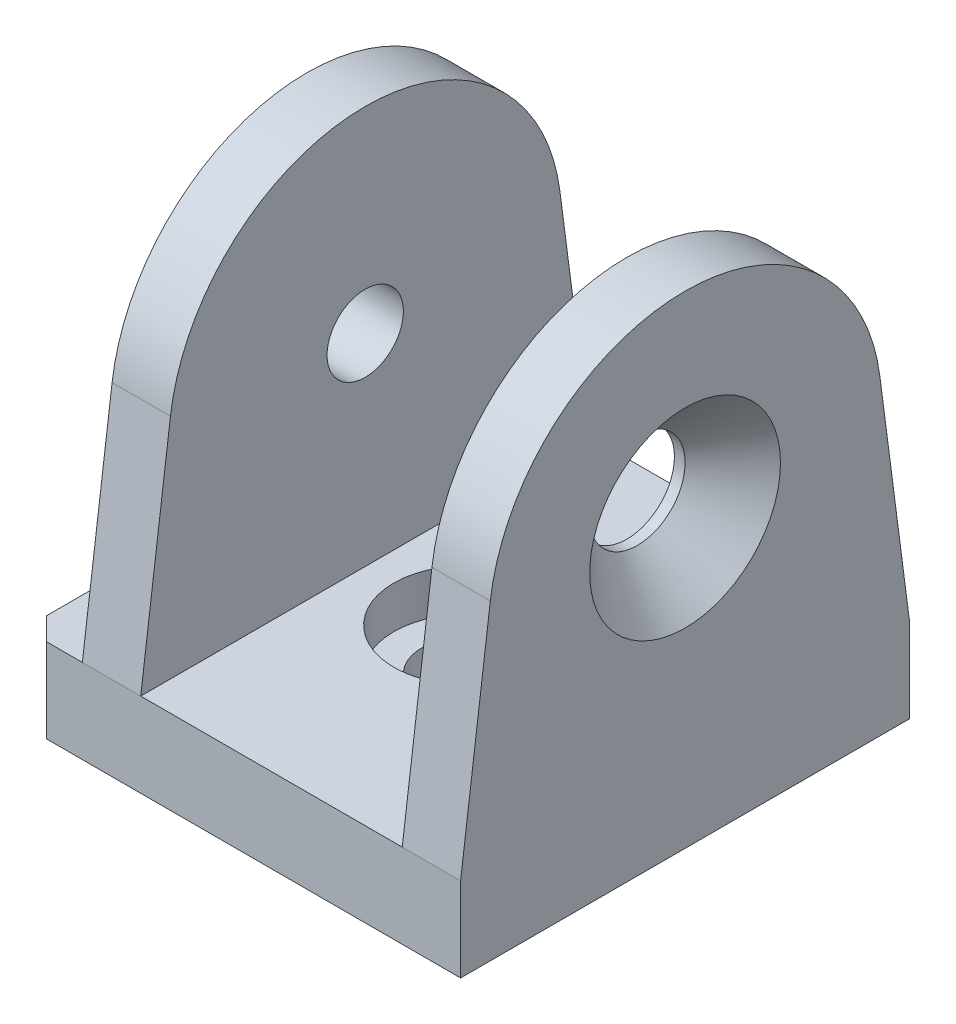
ISO-10303-21;
HEADER;
FILE_DESCRIPTION(('STEP AP214'),'2;1');
FILE_NAME('part.step','',(''),(''),'','','');
FILE_SCHEMA(('AUTOMOTIVE_DESIGN { 1 0 10303 214 1 1 1 1 }'));
ENDSEC;
DATA;
#1=APPLICATION_CONTEXT('core data for automotive mechanical design processes');
#2=APPLICATION_PROTOCOL_DEFINITION('international standard','automotive_design',2000,#1);
#3=PRODUCT_CONTEXT('',#1,'mechanical');
#4=PRODUCT('Part','Part','',(#3));
#5=PRODUCT_RELATED_PRODUCT_CATEGORY('part','',(#4));
#6=PRODUCT_DEFINITION_FORMATION('','',#4);
#7=PRODUCT_DEFINITION_CONTEXT('part definition',#1,'design');
#8=PRODUCT_DEFINITION('design','',#6,#7);
#9=PRODUCT_DEFINITION_SHAPE('','',#8);
#10=(LENGTH_UNIT() NAMED_UNIT(*) SI_UNIT(.MILLI.,.METRE.));
#11=(NAMED_UNIT(*) PLANE_ANGLE_UNIT() SI_UNIT($,.RADIAN.));
#12=(NAMED_UNIT(*) SI_UNIT($,.STERADIAN.) SOLID_ANGLE_UNIT());
#13=UNCERTAINTY_MEASURE_WITH_UNIT(LENGTH_MEASURE(1.E-05),#10,'distance_accuracy_value','');
#14=(GEOMETRIC_REPRESENTATION_CONTEXT(3) GLOBAL_UNCERTAINTY_ASSIGNED_CONTEXT((#13)) GLOBAL_UNIT_ASSIGNED_CONTEXT((#10,
#11,#12)) REPRESENTATION_CONTEXT('',''));
#15=CARTESIAN_POINT('',(0.,0.,0.));
#16=DIRECTION('',(0.,0.,1.));
#17=DIRECTION('',(1.,0.,0.));
#18=AXIS2_PLACEMENT_3D('',#15,#16,#17);
#19=CARTESIAN_POINT('',(-14.25,27.7667495892119,-17.3525746302907));
#20=DIRECTION('',(0.,0.129528547954964,-0.991575693159468));
#21=DIRECTION('',(0.,0.991575693159468,0.129528547954964));
#22=AXIS2_PLACEMENT_3D('',#19,#20,#21);
#23=PLANE('',#22);
#24=DIRECTION('',(0.,-0.991575693159468,-0.129528547954964));
#25=VECTOR('',#24,1.);
#26=CARTESIAN_POINT('',(14.25,27.7667495892119,-17.3525746302907));
#27=LINE('',#26,#25);
#28=CARTESIAN_POINT('',(14.25,27.7667495892119,-17.3525746302907));
#29=VERTEX_POINT('',#28);
#30=CARTESIAN_POINT('',(14.25,7.5,-20.));
#31=VERTEX_POINT('',#30);
#32=EDGE_CURVE('E145',#29,#31,#27,.T.);
#33=ORIENTED_EDGE('',*,*,#32,.F.);
#34=DIRECTION('',(1.,0.,0.));
#35=VECTOR('',#34,1.);
#36=CARTESIAN_POINT('',(-14.25,27.7667495892119,-17.3525746302907));
#37=LINE('',#36,#35);
#38=CARTESIAN_POINT('',(19.45,27.7667495892119,-17.3525746302907));
#39=VERTEX_POINT('',#38);
#40=EDGE_CURVE('E190',#29,#39,#37,.T.);
#41=ORIENTED_EDGE('',*,*,#40,.T.);
#42=DIRECTION('',(0.,0.991575693159468,0.129528547954964));
#43=VECTOR('',#42,1.);
#44=CARTESIAN_POINT('',(19.45,27.7667495892119,-17.3525746302907));
#45=LINE('',#44,#43);
#46=CARTESIAN_POINT('',(19.45,7.5,-20.));
#47=VERTEX_POINT('',#46);
#48=EDGE_CURVE('E258',#47,#39,#45,.T.);
#49=ORIENTED_EDGE('',*,*,#48,.F.);
#50=DIRECTION('',(-1.,0.,0.));
#51=VECTOR('',#50,1.);
#52=CARTESIAN_POINT('',(19.45,7.5,-20.));
#53=LINE('',#52,#51);
#54=EDGE_CURVE('E211',#47,#31,#53,.T.);
#55=ORIENTED_EDGE('',*,*,#54,.T.);
#56=EDGE_LOOP('',(#33,#41,#49,#55));
#57=FACE_BOUND('',#56,.T.);
#58=ADVANCED_FACE('F39',(#57),#23,.T.);
#59=CARTESIAN_POINT('',(-14.25,25.5,0.));
#60=DIRECTION('',(1.,0.,0.));
#61=DIRECTION('',(0.,0.,-1.));
#62=AXIS2_PLACEMENT_3D('',#59,#60,#61);
#63=CYLINDRICAL_SURFACE('',#62,17.5);
#64=DIRECTION('',(1.,0.,0.));
#65=VECTOR('',#64,1.);
#66=CARTESIAN_POINT('',(-14.25,27.7667495892119,17.3525746302907));
#67=LINE('',#66,#65);
#68=CARTESIAN_POINT('',(-14.25,27.7667495892119,17.3525746302907));
#69=VERTEX_POINT('',#68);
#70=CARTESIAN_POINT('',(-9.05000000000001,27.7667495892119,17.3525746302907));
#71=VERTEX_POINT('',#70);
#72=EDGE_CURVE('E178',#69,#71,#67,.T.);
#73=ORIENTED_EDGE('',*,*,#72,.T.);
#74=CARTESIAN_POINT('',(-9.05000000000001,25.5,0.));
#75=DIRECTION('',(-1.,0.,0.));
#76=DIRECTION('',(0.,-1.,0.));
#77=AXIS2_PLACEMENT_3D('',#74,#75,#76);
#78=CIRCLE('',#77,17.5);
#79=CARTESIAN_POINT('',(-9.05000000000001,27.7667495892119,-17.3525746302907));
#80=VERTEX_POINT('',#79);
#81=EDGE_CURVE('E149',#80,#71,#78,.F.);
#82=ORIENTED_EDGE('',*,*,#81,.F.);
#83=CARTESIAN_POINT('',(-14.25,27.7667495892119,-17.3525746302907));
#84=VERTEX_POINT('',#83);
#85=EDGE_CURVE('E187',#84,#80,#37,.T.);
#86=ORIENTED_EDGE('',*,*,#85,.F.);
#87=CARTESIAN_POINT('',(-14.25,25.5,0.));
#88=DIRECTION('',(1.,0.,0.));
#89=DIRECTION('',(0.,0.,1.));
#90=AXIS2_PLACEMENT_3D('',#87,#88,#89);
#91=CIRCLE('',#90,17.5);
#92=EDGE_CURVE('E313',#84,#69,#91,.T.);
#93=ORIENTED_EDGE('',*,*,#92,.T.);
#94=EDGE_LOOP('',(#73,#82,#86,#93));
#95=FACE_BOUND('',#94,.T.);
#96=ADVANCED_FACE('F273',(#95),#63,.T.);
#97=CARTESIAN_POINT('',(-14.25,7.5,20.));
#98=DIRECTION('',(0.,0.129528547954964,0.991575693159468));
#99=DIRECTION('',(0.,-0.991575693159468,0.129528547954964));
#100=AXIS2_PLACEMENT_3D('',#97,#98,#99);
#101=PLANE('',#100);
#102=DIRECTION('',(0.,0.991575693159468,-0.129528547954964));
#103=VECTOR('',#102,1.);
#104=CARTESIAN_POINT('',(14.25,7.5,20.));
#105=LINE('',#104,#103);
#106=CARTESIAN_POINT('',(14.25,7.5,20.));
#107=VERTEX_POINT('',#106);
#108=CARTESIAN_POINT('',(14.25,27.7667495892119,17.3525746302907));
#109=VERTEX_POINT('',#108);
#110=EDGE_CURVE('E142',#107,#109,#105,.T.);
#111=ORIENTED_EDGE('',*,*,#110,.F.);
#112=DIRECTION('',(1.,0.,0.));
#113=VECTOR('',#112,1.);
#114=CARTESIAN_POINT('',(-14.25,7.5,20.));
#115=LINE('',#114,#113);
#116=CARTESIAN_POINT('',(19.45,7.5,20.));
#117=VERTEX_POINT('',#116);
#118=EDGE_CURVE('E167',#107,#117,#115,.T.);
#119=ORIENTED_EDGE('',*,*,#118,.T.);
#120=DIRECTION('',(0.,-0.991575693159468,0.129528547954964));
#121=VECTOR('',#120,1.);
#122=CARTESIAN_POINT('',(19.45,7.5,20.));
#123=LINE('',#122,#121);
#124=CARTESIAN_POINT('',(19.45,27.7667495892119,17.3525746302907));
#125=VERTEX_POINT('',#124);
#126=EDGE_CURVE('E184',#125,#117,#123,.T.);
#127=ORIENTED_EDGE('',*,*,#126,.F.);
#128=EDGE_CURVE('E169',#109,#125,#67,.T.);
#129=ORIENTED_EDGE('',*,*,#128,.F.);
#130=EDGE_LOOP('',(#111,#119,#127,#129));
#131=FACE_BOUND('',#130,.T.);
#132=ADVANCED_FACE('F165',(#131),#101,.T.);
#133=CARTESIAN_POINT('',(0.,7.5,0.));
#134=DIRECTION('',(0.,1.,0.));
#135=DIRECTION('',(0.,0.,1.));
#136=AXIS2_PLACEMENT_3D('',#133,#134,#135);
#137=PLANE('',#136);
#138=CARTESIAN_POINT('',(-14.25,7.5,-20.));
#139=VERTEX_POINT('',#138);
#140=CARTESIAN_POINT('',(-17.45,7.5,-20.));
#141=VERTEX_POINT('',#140);
#142=EDGE_CURVE('E210',#139,#141,#53,.T.);
#143=ORIENTED_EDGE('',*,*,#142,.T.);
#144=DIRECTION('',(0.707106781186549,0.,-0.707106781186546));
#145=VECTOR('',#144,1.);
#146=CARTESIAN_POINT('',(-18.725,7.5,-18.725));
#147=LINE('',#146,#145);
#148=CARTESIAN_POINT('',(-19.45,7.5,-18.));
#149=VERTEX_POINT('',#148);
#150=EDGE_CURVE('E48',#141,#149,#147,.F.);
#151=ORIENTED_EDGE('',*,*,#150,.T.);
#152=DIRECTION('',(0.,0.,1.));
#153=VECTOR('',#152,1.);
#154=CARTESIAN_POINT('',(-19.45,7.5,20.));
#155=LINE('',#154,#153);
#156=CARTESIAN_POINT('',(-19.45,7.5,18.));
#157=VERTEX_POINT('',#156);
#158=EDGE_CURVE('E205',#149,#157,#155,.T.);
#159=ORIENTED_EDGE('',*,*,#158,.T.);
#160=DIRECTION('',(-0.707106781186546,0.,-0.707106781186549));
#161=VECTOR('',#160,1.);
#162=CARTESIAN_POINT('',(-18.725,7.5,18.725));
#163=LINE('',#162,#161);
#164=CARTESIAN_POINT('',(-17.45,7.5,20.));
#165=VERTEX_POINT('',#164);
#166=EDGE_CURVE('E55',#157,#165,#163,.F.);
#167=ORIENTED_EDGE('',*,*,#166,.T.);
#168=DIRECTION('',(1.,0.,0.));
#169=VECTOR('',#168,1.);
#170=CARTESIAN_POINT('',(19.45,7.5,20.));
#171=LINE('',#170,#169);
#172=CARTESIAN_POINT('',(-14.25,7.5,20.));
#173=VERTEX_POINT('',#172);
#174=EDGE_CURVE('E207',#165,#173,#171,.T.);
#175=ORIENTED_EDGE('',*,*,#174,.T.);
#176=DIRECTION('',(0.,0.,-1.));
#177=VECTOR('',#176,1.);
#178=CARTESIAN_POINT('',(-14.25,7.5,-20.));
#179=LINE('',#178,#177);
#180=EDGE_CURVE('E318',#173,#139,#179,.T.);
#181=ORIENTED_EDGE('',*,*,#180,.T.);
#182=EDGE_LOOP('',(#143,#151,#159,#167,#175,#181));
#183=FACE_BOUND('',#182,.T.);
#184=ADVANCED_FACE('F238',(#183),#137,.T.);
#185=CARTESIAN_POINT('',(-19.45,7.5,20.));
#186=DIRECTION('',(1.,0.,0.));
#187=DIRECTION('',(0.,0.,-1.));
#188=AXIS2_PLACEMENT_3D('',#185,#186,#187);
#189=PLANE('',#188);
#190=ORIENTED_EDGE('',*,*,#158,.F.);
#191=DIRECTION('',(0.,-1.,0.));
#192=VECTOR('',#191,1.);
#193=CARTESIAN_POINT('',(-19.45,7.5,-18.));
#194=LINE('',#193,#192);
#195=CARTESIAN_POINT('',(-19.45,0.,-18.));
#196=VERTEX_POINT('',#195);
#197=EDGE_CURVE('E228',#149,#196,#194,.T.);
#198=ORIENTED_EDGE('',*,*,#197,.T.);
#199=DIRECTION('',(0.,0.,1.));
#200=VECTOR('',#199,1.);
#201=CARTESIAN_POINT('',(-19.45,0.,20.));
#202=LINE('',#201,#200);
#203=CARTESIAN_POINT('',(-19.45,0.,18.));
#204=VERTEX_POINT('',#203);
#205=EDGE_CURVE('E204',#196,#204,#202,.T.);
#206=ORIENTED_EDGE('',*,*,#205,.T.);
#207=DIRECTION('',(0.,1.,0.));
#208=VECTOR('',#207,1.);
#209=CARTESIAN_POINT('',(-19.45,7.5,18.));
#210=LINE('',#209,#208);
#211=EDGE_CURVE('E170',#204,#157,#210,.T.);
#212=ORIENTED_EDGE('',*,*,#211,.T.);
#213=EDGE_LOOP('',(#190,#198,#206,#212));
#214=FACE_BOUND('',#213,.T.);
#215=ADVANCED_FACE('F243',(#214),#189,.F.);
#216=CARTESIAN_POINT('',(19.45,7.5,20.));
#217=DIRECTION('',(0.,0.,-1.));
#218=DIRECTION('',(-1.,0.,0.));
#219=AXIS2_PLACEMENT_3D('',#216,#217,#218);
#220=PLANE('',#219);
#221=ORIENTED_EDGE('',*,*,#174,.F.);
#222=DIRECTION('',(0.,-1.,0.));
#223=VECTOR('',#222,1.);
#224=CARTESIAN_POINT('',(-17.45,7.5,20.));
#225=LINE('',#224,#223);
#226=CARTESIAN_POINT('',(-17.45,0.,20.));
#227=VERTEX_POINT('',#226);
#228=EDGE_CURVE('E11',#165,#227,#225,.T.);
#229=ORIENTED_EDGE('',*,*,#228,.T.);
#230=DIRECTION('',(1.,0.,0.));
#231=VECTOR('',#230,1.);
#232=CARTESIAN_POINT('',(19.45,0.,20.));
#233=LINE('',#232,#231);
#234=CARTESIAN_POINT('',(19.45,0.,20.));
#235=VERTEX_POINT('',#234);
#236=EDGE_CURVE('E218',#227,#235,#233,.T.);
#237=ORIENTED_EDGE('',*,*,#236,.T.);
#238=DIRECTION('',(0.,-1.,0.));
#239=VECTOR('',#238,1.);
#240=CARTESIAN_POINT('',(19.45,7.5,20.));
#241=LINE('',#240,#239);
#242=EDGE_CURVE('E176',#117,#235,#241,.T.);
#243=ORIENTED_EDGE('',*,*,#242,.F.);
#244=ORIENTED_EDGE('',*,*,#118,.F.);
#245=DIRECTION('',(1.,0.,0.));
#246=VECTOR('',#245,1.);
#247=CARTESIAN_POINT('',(14.25,7.5,20.));
#248=LINE('',#247,#246);
#249=CARTESIAN_POINT('',(-9.05000000000001,7.5,20.));
#250=VERTEX_POINT('',#249);
#251=EDGE_CURVE('E153',#250,#107,#248,.T.);
#252=ORIENTED_EDGE('',*,*,#251,.F.);
#253=EDGE_CURVE('E177',#173,#250,#115,.T.);
#254=ORIENTED_EDGE('',*,*,#253,.F.);
#255=EDGE_LOOP('',(#221,#229,#237,#243,#244,#252,#254));
#256=FACE_BOUND('',#255,.T.);
#257=ADVANCED_FACE('F174',(#256),#220,.F.);
#258=CARTESIAN_POINT('',(19.45,7.5,20.));
#259=DIRECTION('',(-1.,0.,0.));
#260=DIRECTION('',(0.,0.,1.));
#261=AXIS2_PLACEMENT_3D('',#258,#259,#260);
#262=PLANE('',#261);
#263=CARTESIAN_POINT('',(19.45,25.5,0.));
#264=DIRECTION('',(1.,0.,0.));
#265=DIRECTION('',(0.,0.,-1.));
#266=AXIS2_PLACEMENT_3D('',#263,#264,#265);
#267=CIRCLE('',#266,8.5);
#268=CARTESIAN_POINT('',(19.45,25.5,-8.5));
#269=VERTEX_POINT('',#268);
#270=EDGE_CURVE('E328',#269,#269,#267,.T.);
#271=ORIENTED_EDGE('',*,*,#270,.F.);
#272=EDGE_LOOP('',(#271));
#273=FACE_BOUND('',#272,.T.);
#274=DIRECTION('',(0.,0.,-1.));
#275=VECTOR('',#274,1.);
#276=CARTESIAN_POINT('',(19.45,0.,20.));
#277=LINE('',#276,#275);
#278=CARTESIAN_POINT('',(19.45,0.,-20.));
#279=VERTEX_POINT('',#278);
#280=EDGE_CURVE('E220',#235,#279,#277,.T.);
#281=ORIENTED_EDGE('',*,*,#280,.T.);
#282=DIRECTION('',(0.,-1.,0.));
#283=VECTOR('',#282,1.);
#284=CARTESIAN_POINT('',(19.45,7.5,-20.));
#285=LINE('',#284,#283);
#286=EDGE_CURVE('E214',#47,#279,#285,.T.);
#287=ORIENTED_EDGE('',*,*,#286,.F.);
#288=ORIENTED_EDGE('',*,*,#48,.T.);
#289=CARTESIAN_POINT('',(19.45,25.5,0.));
#290=DIRECTION('',(1.,0.,0.));
#291=DIRECTION('',(0.,0.,1.));
#292=AXIS2_PLACEMENT_3D('',#289,#290,#291);
#293=CIRCLE('',#292,17.5);
#294=EDGE_CURVE('E306',#39,#125,#293,.T.);
#295=ORIENTED_EDGE('',*,*,#294,.T.);
#296=ORIENTED_EDGE('',*,*,#126,.T.);
#297=ORIENTED_EDGE('',*,*,#242,.T.);
#298=EDGE_LOOP('',(#281,#287,#288,#295,#296,#297));
#299=FACE_BOUND('',#298,.T.);
#300=ADVANCED_FACE('F256',(#273,#299),#262,.F.);
#301=CARTESIAN_POINT('',(19.45,7.5,-20.));
#302=DIRECTION('',(0.,0.,1.));
#303=DIRECTION('',(1.,0.,0.));
#304=AXIS2_PLACEMENT_3D('',#301,#302,#303);
#305=PLANE('',#304);
#306=DIRECTION('',(-1.,0.,0.));
#307=VECTOR('',#306,1.);
#308=CARTESIAN_POINT('',(19.45,0.,-20.));
#309=LINE('',#308,#307);
#310=CARTESIAN_POINT('',(-17.45,0.,-20.));
#311=VERTEX_POINT('',#310);
#312=EDGE_CURVE('E208',#279,#311,#309,.T.);
#313=ORIENTED_EDGE('',*,*,#312,.T.);
#314=DIRECTION('',(0.,1.,0.));
#315=VECTOR('',#314,1.);
#316=CARTESIAN_POINT('',(-17.45,7.5,-20.));
#317=LINE('',#316,#315);
#318=EDGE_CURVE('E63',#311,#141,#317,.T.);
#319=ORIENTED_EDGE('',*,*,#318,.T.);
#320=ORIENTED_EDGE('',*,*,#142,.F.);
#321=CARTESIAN_POINT('',(-9.05,7.5,-20.));
#322=VERTEX_POINT('',#321);
#323=EDGE_CURVE('E215',#322,#139,#53,.T.);
#324=ORIENTED_EDGE('',*,*,#323,.F.);
#325=DIRECTION('',(1.,0.,0.));
#326=VECTOR('',#325,1.);
#327=CARTESIAN_POINT('',(14.25,7.5,-20.));
#328=LINE('',#327,#326);
#329=EDGE_CURVE('E161',#322,#31,#328,.T.);
#330=ORIENTED_EDGE('',*,*,#329,.T.);
#331=ORIENTED_EDGE('',*,*,#54,.F.);
#332=ORIENTED_EDGE('',*,*,#286,.T.);
#333=EDGE_LOOP('',(#313,#319,#320,#324,#330,#331,#332));
#334=FACE_BOUND('',#333,.T.);
#335=ADVANCED_FACE('F251',(#334),#305,.F.);
#336=CARTESIAN_POINT('',(0.,0.,0.));
#337=DIRECTION('',(0.,1.,0.));
#338=DIRECTION('',(0.,0.,1.));
#339=AXIS2_PLACEMENT_3D('',#336,#337,#338);
#340=PLANE('',#339);
#341=CARTESIAN_POINT('',(0.,0.,0.));
#342=DIRECTION('',(0.,1.,0.));
#343=DIRECTION('',(-1.,0.,0.));
#344=AXIS2_PLACEMENT_3D('',#341,#342,#343);
#345=CIRCLE('',#344,4.);
#346=CARTESIAN_POINT('',(-4.,0.,0.));
#347=VERTEX_POINT('',#346);
#348=EDGE_CURVE('E201',#347,#347,#345,.T.);
#349=ORIENTED_EDGE('',*,*,#348,.T.);
#350=EDGE_LOOP('',(#349));
#351=FACE_BOUND('',#350,.T.);
#352=ORIENTED_EDGE('',*,*,#205,.F.);
#353=DIRECTION('',(-0.707106781186549,0.,0.707106781186546));
#354=VECTOR('',#353,1.);
#355=CARTESIAN_POINT('',(-19.45,0.,-18.));
#356=LINE('',#355,#354);
#357=EDGE_CURVE('E233',#196,#311,#356,.F.);
#358=ORIENTED_EDGE('',*,*,#357,.T.);
#359=ORIENTED_EDGE('',*,*,#312,.F.);
#360=ORIENTED_EDGE('',*,*,#280,.F.);
#361=ORIENTED_EDGE('',*,*,#236,.F.);
#362=DIRECTION('',(0.707106781186546,0.,0.707106781186549));
#363=VECTOR('',#362,1.);
#364=CARTESIAN_POINT('',(-17.45,0.,20.));
#365=LINE('',#364,#363);
#366=EDGE_CURVE('E231',#227,#204,#365,.F.);
#367=ORIENTED_EDGE('',*,*,#366,.T.);
#368=EDGE_LOOP('',(#352,#358,#359,#360,#361,#367));
#369=FACE_BOUND('',#368,.T.);
#370=ADVANCED_FACE('F249',(#351,#369),#340,.F.);
#371=CARTESIAN_POINT('',(0.,7.5,0.));
#372=DIRECTION('',(0.,1.,0.));
#373=DIRECTION('',(-1.,0.,0.));
#374=AXIS2_PLACEMENT_3D('',#371,#372,#373);
#375=CYLINDRICAL_SURFACE('',#374,4.);
#376=ORIENTED_EDGE('',*,*,#348,.F.);
#377=EDGE_LOOP('',(#376));
#378=FACE_BOUND('',#377,.T.);
#379=CARTESIAN_POINT('',(0.,3.75,0.));
#380=DIRECTION('',(0.,1.,0.));
#381=DIRECTION('',(-1.,0.,0.));
#382=AXIS2_PLACEMENT_3D('',#379,#380,#381);
#383=CIRCLE('',#382,4.);
#384=CARTESIAN_POINT('',(-4.,3.75,0.));
#385=VERTEX_POINT('',#384);
#386=EDGE_CURVE('E198',#385,#385,#383,.T.);
#387=ORIENTED_EDGE('',*,*,#386,.T.);
#388=EDGE_LOOP('',(#387));
#389=FACE_BOUND('',#388,.T.);
#390=ADVANCED_FACE('F370',(#378,#389),#375,.F.);
#391=CARTESIAN_POINT('',(-4.,3.75,0.));
#392=DIRECTION('',(0.,-1.,0.));
#393=DIRECTION('',(1.,0.,0.));
#394=AXIS2_PLACEMENT_3D('',#391,#392,#393);
#395=PLANE('',#394);
#396=ORIENTED_EDGE('',*,*,#386,.F.);
#397=EDGE_LOOP('',(#396));
#398=FACE_BOUND('',#397,.T.);
#399=CARTESIAN_POINT('',(0.,3.75000000000001,0.));
#400=DIRECTION('',(0.,1.,0.));
#401=DIRECTION('',(-1.,0.,0.));
#402=AXIS2_PLACEMENT_3D('',#399,#400,#401);
#403=CIRCLE('',#402,6.5);
#404=CARTESIAN_POINT('',(-6.5,3.75,0.));
#405=VERTEX_POINT('',#404);
#406=EDGE_CURVE('E180',#405,#405,#403,.T.);
#407=ORIENTED_EDGE('',*,*,#406,.T.);
#408=EDGE_LOOP('',(#407));
#409=FACE_BOUND('',#408,.T.);
#410=ADVANCED_FACE('F410',(#398,#409),#395,.F.);
#411=CARTESIAN_POINT('',(0.,7.5,0.));
#412=DIRECTION('',(0.,1.,0.));
#413=DIRECTION('',(-1.,0.,0.));
#414=AXIS2_PLACEMENT_3D('',#411,#412,#413);
#415=CYLINDRICAL_SURFACE('',#414,6.5);
#416=ORIENTED_EDGE('',*,*,#406,.F.);
#417=EDGE_LOOP('',(#416));
#418=FACE_BOUND('',#417,.T.);
#419=CARTESIAN_POINT('',(0.,7.50000000000001,0.));
#420=DIRECTION('',(0.,1.,0.));
#421=DIRECTION('',(-1.,0.,0.));
#422=AXIS2_PLACEMENT_3D('',#419,#420,#421);
#423=CIRCLE('',#422,6.5);
#424=CARTESIAN_POINT('',(-6.5,7.5,0.));
#425=VERTEX_POINT('',#424);
#426=EDGE_CURVE('E191',#425,#425,#423,.T.);
#427=ORIENTED_EDGE('',*,*,#426,.T.);
#428=EDGE_LOOP('',(#427));
#429=FACE_BOUND('',#428,.T.);
#430=ADVANCED_FACE('F293',(#418,#429),#415,.F.);
#431=CARTESIAN_POINT('',(-14.25,25.5,0.));
#432=DIRECTION('',(-1.,0.,0.));
#433=DIRECTION('',(0.,0.,1.));
#434=AXIS2_PLACEMENT_3D('',#431,#432,#433);
#435=PLANE('',#434);
#436=CARTESIAN_POINT('',(-14.25,25.5,0.));
#437=DIRECTION('',(-1.,0.,0.));
#438=DIRECTION('',(0.,0.,1.));
#439=AXIS2_PLACEMENT_3D('',#436,#437,#438);
#440=CIRCLE('',#439,3.4);
#441=CARTESIAN_POINT('',(-14.25,25.5,3.4));
#442=VERTEX_POINT('',#441);
#443=EDGE_CURVE('E334',#442,#442,#440,.T.);
#444=ORIENTED_EDGE('',*,*,#443,.F.);
#445=EDGE_LOOP('',(#444));
#446=FACE_BOUND('',#445,.T.);
#447=ORIENTED_EDGE('',*,*,#180,.F.);
#448=DIRECTION('',(0.,-0.991575693159468,0.129528547954964));
#449=VECTOR('',#448,1.);
#450=CARTESIAN_POINT('',(-14.25,7.5,20.));
#451=LINE('',#450,#449);
#452=EDGE_CURVE('E310',#69,#173,#451,.T.);
#453=ORIENTED_EDGE('',*,*,#452,.F.);
#454=ORIENTED_EDGE('',*,*,#92,.F.);
#455=DIRECTION('',(0.,0.991575693159468,0.129528547954964));
#456=VECTOR('',#455,1.);
#457=CARTESIAN_POINT('',(-14.25,27.7667495892119,-17.3525746302907));
#458=LINE('',#457,#456);
#459=EDGE_CURVE('E316',#139,#84,#458,.T.);
#460=ORIENTED_EDGE('',*,*,#459,.F.);
#461=EDGE_LOOP('',(#447,#453,#454,#460));
#462=FACE_BOUND('',#461,.T.);
#463=ADVANCED_FACE('F285',(#446,#462),#435,.T.);
#464=DIRECTION('',(0.,0.991575693159468,0.129528547954964));
#465=VECTOR('',#464,1.);
#466=CARTESIAN_POINT('',(-9.05000000000001,27.7667495892119,-17.3525746302907));
#467=LINE('',#466,#465);
#468=EDGE_CURVE('E195',#322,#80,#467,.T.);
#469=ORIENTED_EDGE('',*,*,#468,.F.);
#470=ORIENTED_EDGE('',*,*,#323,.T.);
#471=ORIENTED_EDGE('',*,*,#459,.T.);
#472=ORIENTED_EDGE('',*,*,#85,.T.);
#473=EDGE_LOOP('',(#469,#470,#471,#472));
#474=FACE_BOUND('',#473,.T.);
#475=ADVANCED_FACE('F276',(#474),#23,.T.);
#476=CARTESIAN_POINT('',(14.25,25.5,0.));
#477=DIRECTION('',(1.,0.,0.));
#478=DIRECTION('',(0.,0.,-1.));
#479=AXIS2_PLACEMENT_3D('',#476,#477,#478);
#480=CIRCLE('',#479,17.5);
#481=EDGE_CURVE('E194',#109,#29,#480,.F.);
#482=ORIENTED_EDGE('',*,*,#481,.F.);
#483=ORIENTED_EDGE('',*,*,#128,.T.);
#484=ORIENTED_EDGE('',*,*,#294,.F.);
#485=ORIENTED_EDGE('',*,*,#40,.F.);
#486=EDGE_LOOP('',(#482,#483,#484,#485));
#487=FACE_BOUND('',#486,.T.);
#488=ADVANCED_FACE('F282',(#487),#63,.T.);
#489=DIRECTION('',(0.,-0.991575693159468,0.129528547954964));
#490=VECTOR('',#489,1.);
#491=CARTESIAN_POINT('',(-9.05,7.5,20.));
#492=LINE('',#491,#490);
#493=EDGE_CURVE('E171',#71,#250,#492,.T.);
#494=ORIENTED_EDGE('',*,*,#493,.F.);
#495=ORIENTED_EDGE('',*,*,#72,.F.);
#496=ORIENTED_EDGE('',*,*,#452,.T.);
#497=ORIENTED_EDGE('',*,*,#253,.T.);
#498=EDGE_LOOP('',(#494,#495,#496,#497));
#499=FACE_BOUND('',#498,.T.);
#500=ADVANCED_FACE('F291',(#499),#101,.T.);
#501=CARTESIAN_POINT('',(14.25,7.5,-20.));
#502=DIRECTION('',(0.,-1.,0.));
#503=DIRECTION('',(1.,0.,0.));
#504=AXIS2_PLACEMENT_3D('',#501,#502,#503);
#505=PLANE('',#504);
#506=DIRECTION('',(0.,0.,1.));
#507=VECTOR('',#506,1.);
#508=CARTESIAN_POINT('',(14.25,7.5,-20.));
#509=LINE('',#508,#507);
#510=EDGE_CURVE('E138',#31,#107,#509,.T.);
#511=ORIENTED_EDGE('',*,*,#510,.F.);
#512=ORIENTED_EDGE('',*,*,#329,.F.);
#513=DIRECTION('',(0.,0.,1.));
#514=VECTOR('',#513,1.);
#515=CARTESIAN_POINT('',(-9.05,7.5,-20.));
#516=LINE('',#515,#514);
#517=EDGE_CURVE('E150',#322,#250,#516,.T.);
#518=ORIENTED_EDGE('',*,*,#517,.T.);
#519=ORIENTED_EDGE('',*,*,#251,.T.);
#520=EDGE_LOOP('',(#511,#512,#518,#519));
#521=FACE_BOUND('',#520,.T.);
#522=ORIENTED_EDGE('',*,*,#426,.F.);
#523=EDGE_LOOP('',(#522));
#524=FACE_BOUND('',#523,.T.);
#525=ADVANCED_FACE('F154',(#521,#524),#505,.F.);
#526=CARTESIAN_POINT('',(14.25,7.5,-20.));
#527=DIRECTION('',(1.,0.,0.));
#528=DIRECTION('',(0.,0.,-1.));
#529=AXIS2_PLACEMENT_3D('',#526,#527,#528);
#530=PLANE('',#529);
#531=CARTESIAN_POINT('',(14.25,25.5,0.));
#532=DIRECTION('',(1.,0.,0.));
#533=DIRECTION('',(0.,0.,-1.));
#534=AXIS2_PLACEMENT_3D('',#531,#532,#533);
#535=CIRCLE('',#534,4.25);
#536=CARTESIAN_POINT('',(14.25,25.5,-4.25));
#537=VERTEX_POINT('',#536);
#538=EDGE_CURVE('E162',#537,#537,#535,.T.);
#539=ORIENTED_EDGE('',*,*,#538,.T.);
#540=EDGE_LOOP('',(#539));
#541=FACE_BOUND('',#540,.T.);
#542=ORIENTED_EDGE('',*,*,#32,.T.);
#543=ORIENTED_EDGE('',*,*,#510,.T.);
#544=ORIENTED_EDGE('',*,*,#110,.T.);
#545=ORIENTED_EDGE('',*,*,#481,.T.);
#546=EDGE_LOOP('',(#542,#543,#544,#545));
#547=FACE_BOUND('',#546,.T.);
#548=ADVANCED_FACE('F140',(#541,#547),#530,.F.);
#549=CARTESIAN_POINT('',(-9.05,7.5,-20.));
#550=DIRECTION('',(-1.,0.,0.));
#551=DIRECTION('',(0.,-1.,0.));
#552=AXIS2_PLACEMENT_3D('',#549,#550,#551);
#553=PLANE('',#552);
#554=CARTESIAN_POINT('',(-9.05000000000001,25.5,0.));
#555=DIRECTION('',(-1.,0.,0.));
#556=DIRECTION('',(0.,-1.,0.));
#557=AXIS2_PLACEMENT_3D('',#554,#555,#556);
#558=CIRCLE('',#557,3.4);
#559=CARTESIAN_POINT('',(-9.05000000000001,22.1,0.));
#560=VERTEX_POINT('',#559);
#561=EDGE_CURVE('E331',#560,#560,#558,.T.);
#562=ORIENTED_EDGE('',*,*,#561,.T.);
#563=EDGE_LOOP('',(#562));
#564=FACE_BOUND('',#563,.T.);
#565=ORIENTED_EDGE('',*,*,#468,.T.);
#566=ORIENTED_EDGE('',*,*,#81,.T.);
#567=ORIENTED_EDGE('',*,*,#493,.T.);
#568=ORIENTED_EDGE('',*,*,#517,.F.);
#569=EDGE_LOOP('',(#565,#566,#567,#568));
#570=FACE_BOUND('',#569,.T.);
#571=ADVANCED_FACE('F271',(#564,#570),#553,.F.);
#572=CARTESIAN_POINT('',(-19.45,7.5,-18.));
#573=DIRECTION('',(0.707106781186546,0.,0.707106781186549));
#574=DIRECTION('',(0.,-1.,0.));
#575=AXIS2_PLACEMENT_3D('',#572,#573,#574);
#576=PLANE('',#575);
#577=ORIENTED_EDGE('',*,*,#150,.F.);
#578=ORIENTED_EDGE('',*,*,#318,.F.);
#579=ORIENTED_EDGE('',*,*,#357,.F.);
#580=ORIENTED_EDGE('',*,*,#197,.F.);
#581=EDGE_LOOP('',(#577,#578,#579,#580));
#582=FACE_BOUND('',#581,.T.);
#583=ADVANCED_FACE('F246',(#582),#576,.F.);
#584=CARTESIAN_POINT('',(-17.45,7.5,20.));
#585=DIRECTION('',(0.707106781186549,0.,-0.707106781186546));
#586=DIRECTION('',(0.,-1.,0.));
#587=AXIS2_PLACEMENT_3D('',#584,#585,#586);
#588=PLANE('',#587);
#589=ORIENTED_EDGE('',*,*,#166,.F.);
#590=ORIENTED_EDGE('',*,*,#211,.F.);
#591=ORIENTED_EDGE('',*,*,#366,.F.);
#592=ORIENTED_EDGE('',*,*,#228,.F.);
#593=EDGE_LOOP('',(#589,#590,#591,#592));
#594=FACE_BOUND('',#593,.T.);
#595=ADVANCED_FACE('F42',(#594),#588,.F.);
#596=CARTESIAN_POINT('',(19.45,25.5,0.));
#597=DIRECTION('',(1.,0.,0.));
#598=DIRECTION('',(0.,0.,-1.));
#599=AXIS2_PLACEMENT_3D('',#596,#597,#598);
#600=CYLINDRICAL_SURFACE('',#599,4.25);
#601=ORIENTED_EDGE('',*,*,#538,.F.);
#602=EDGE_LOOP('',(#601));
#603=FACE_BOUND('',#602,.T.);
#604=CARTESIAN_POINT('',(15.2,25.5,0.));
#605=DIRECTION('',(1.,0.,0.));
#606=DIRECTION('',(0.,0.,-1.));
#607=AXIS2_PLACEMENT_3D('',#604,#605,#606);
#608=CIRCLE('',#607,4.25);
#609=CARTESIAN_POINT('',(15.2,25.5,-4.25));
#610=VERTEX_POINT('',#609);
#611=EDGE_CURVE('E325',#610,#610,#608,.T.);
#612=ORIENTED_EDGE('',*,*,#611,.T.);
#613=EDGE_LOOP('',(#612));
#614=FACE_BOUND('',#613,.T.);
#615=ADVANCED_FACE('F263',(#603,#614),#600,.F.);
#616=CARTESIAN_POINT('',(19.45,25.5,0.));
#617=DIRECTION('',(1.,0.,0.));
#618=DIRECTION('',(0.,0.,-1.));
#619=AXIS2_PLACEMENT_3D('',#616,#617,#618);
#620=CONICAL_SURFACE('',#619,8.5,0.785398163397449);
#621=ORIENTED_EDGE('',*,*,#611,.F.);
#622=EDGE_LOOP('',(#621));
#623=FACE_BOUND('',#622,.T.);
#624=ORIENTED_EDGE('',*,*,#270,.T.);
#625=EDGE_LOOP('',(#624));
#626=FACE_BOUND('',#625,.T.);
#627=ADVANCED_FACE('F268',(#623,#626),#620,.F.);
#628=CARTESIAN_POINT('',(-14.25,25.5,0.));
#629=DIRECTION('',(-1.,0.,0.));
#630=DIRECTION('',(0.,0.,1.));
#631=AXIS2_PLACEMENT_3D('',#628,#629,#630);
#632=CYLINDRICAL_SURFACE('',#631,3.4);
#633=ORIENTED_EDGE('',*,*,#561,.F.);
#634=EDGE_LOOP('',(#633));
#635=FACE_BOUND('',#634,.T.);
#636=ORIENTED_EDGE('',*,*,#443,.T.);
#637=EDGE_LOOP('',(#636));
#638=FACE_BOUND('',#637,.T.);
#639=ADVANCED_FACE('F338',(#635,#638),#632,.F.);
#640=CLOSED_SHELL('',(#58,#96,#132,#184,#215,#257,#300,#335,#370,#390,#410,#430,#463,#475,#488,
#500,#525,#548,#571,#583,#595,#615,#627,#639));
#641=MANIFOLD_SOLID_BREP('B2',#640);
#642=ADVANCED_BREP_SHAPE_REPRESENTATION('',(#18,#641),#14);
#643=SHAPE_DEFINITION_REPRESENTATION(#9,#642);
ENDSEC;
END-ISO-10303-21;
